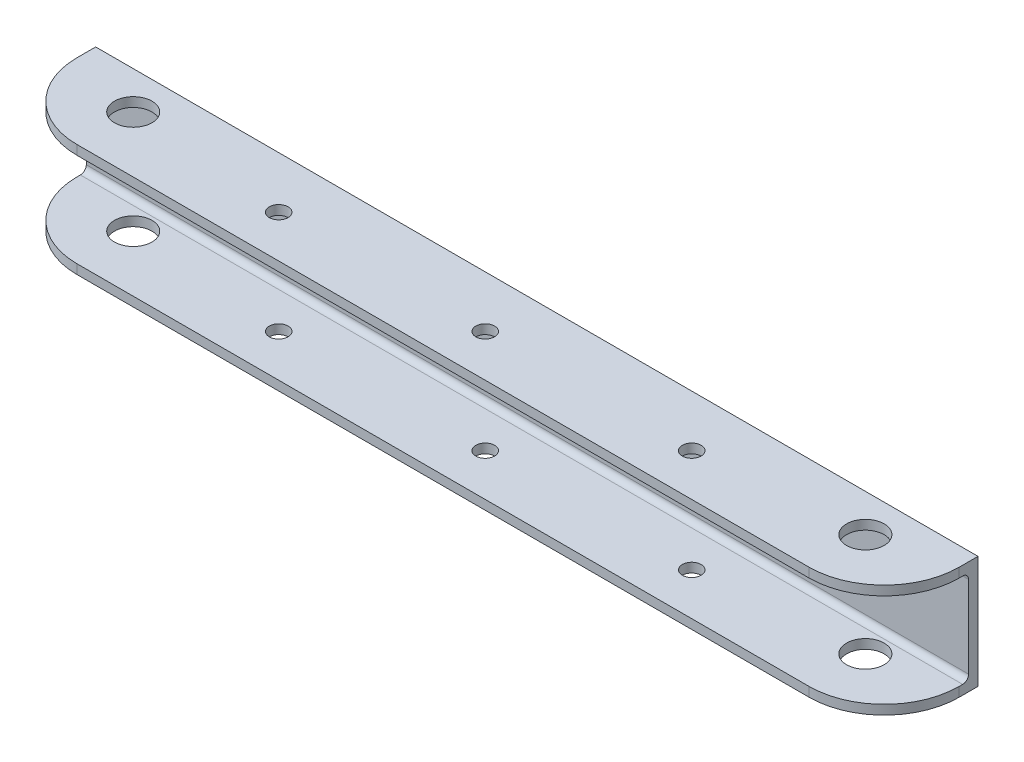
ISO-10303-21;
HEADER;
FILE_DESCRIPTION(('STEP AP214'),'2;1');
FILE_NAME('part.step','',(''),(''),'','','');
FILE_SCHEMA(('AUTOMOTIVE_DESIGN { 1 0 10303 214 1 1 1 1 }'));
ENDSEC;
DATA;
#1=APPLICATION_CONTEXT('core data for automotive mechanical design processes');
#2=APPLICATION_PROTOCOL_DEFINITION('international standard','automotive_design',2000,#1);
#3=PRODUCT_CONTEXT('',#1,'mechanical');
#4=PRODUCT('Part','Part','',(#3));
#5=PRODUCT_RELATED_PRODUCT_CATEGORY('part','',(#4));
#6=PRODUCT_DEFINITION_FORMATION('','',#4);
#7=PRODUCT_DEFINITION_CONTEXT('part definition',#1,'design');
#8=PRODUCT_DEFINITION('design','',#6,#7);
#9=PRODUCT_DEFINITION_SHAPE('','',#8);
#10=(LENGTH_UNIT() NAMED_UNIT(*) SI_UNIT(.MILLI.,.METRE.));
#11=(NAMED_UNIT(*) PLANE_ANGLE_UNIT() SI_UNIT($,.RADIAN.));
#12=(NAMED_UNIT(*) SI_UNIT($,.STERADIAN.) SOLID_ANGLE_UNIT());
#13=UNCERTAINTY_MEASURE_WITH_UNIT(LENGTH_MEASURE(1.E-05),#10,'distance_accuracy_value','');
#14=(GEOMETRIC_REPRESENTATION_CONTEXT(3) GLOBAL_UNCERTAINTY_ASSIGNED_CONTEXT((#13)) GLOBAL_UNIT_ASSIGNED_CONTEXT((#10,
#11,#12)) REPRESENTATION_CONTEXT('',''));
#15=CARTESIAN_POINT('',(0.,0.,0.));
#16=DIRECTION('',(0.,0.,1.));
#17=DIRECTION('',(1.,0.,0.));
#18=AXIS2_PLACEMENT_3D('',#15,#16,#17);
#19=CARTESIAN_POINT('',(0.,0.,31.75));
#20=DIRECTION('',(0.,0.,1.));
#21=DIRECTION('',(1.,0.,0.));
#22=AXIS2_PLACEMENT_3D('',#19,#20,#21);
#23=PLANE('',#22);
#24=DIRECTION('',(-1.,0.,0.));
#25=VECTOR('',#24,1.);
#26=CARTESIAN_POINT('',(0.,0.,31.75));
#27=LINE('',#26,#25);
#28=CARTESIAN_POINT('',(-313.675887252,0.,31.75));
#29=VERTEX_POINT('',#28);
#30=CARTESIAN_POINT('',(-561.325887252,0.,31.75));
#31=VERTEX_POINT('',#30);
#32=EDGE_CURVE('E195',#29,#31,#27,.T.);
#33=ORIENTED_EDGE('',*,*,#32,.F.);
#34=DIRECTION('',(0.,1.,0.));
#35=VECTOR('',#34,1.);
#36=CARTESIAN_POINT('',(-313.675887252,3.17499999999967,31.75));
#37=LINE('',#36,#35);
#38=CARTESIAN_POINT('',(-313.675887252,3.17499999999967,31.75));
#39=VERTEX_POINT('',#38);
#40=EDGE_CURVE('E241',#29,#39,#37,.T.);
#41=ORIENTED_EDGE('',*,*,#40,.T.);
#42=DIRECTION('',(-1.,0.,0.));
#43=VECTOR('',#42,1.);
#44=CARTESIAN_POINT('',(-288.275887252,3.17499999999967,31.75));
#45=LINE('',#44,#43);
#46=CARTESIAN_POINT('',(-561.325887252,3.17499999999967,31.75));
#47=VERTEX_POINT('',#46);
#48=EDGE_CURVE('E178',#39,#47,#45,.T.);
#49=ORIENTED_EDGE('',*,*,#48,.T.);
#50=DIRECTION('',(0.,1.,0.));
#51=VECTOR('',#50,1.);
#52=CARTESIAN_POINT('',(-561.325887252,4.90706239642227E-12,31.75));
#53=LINE('',#52,#51);
#54=EDGE_CURVE('E238',#47,#31,#53,.F.);
#55=ORIENTED_EDGE('',*,*,#54,.T.);
#56=EDGE_LOOP('',(#33,#41,#49,#55));
#57=FACE_BOUND('',#56,.T.);
#58=ADVANCED_FACE('F51',(#57),#23,.T.);
#59=CARTESIAN_POINT('',(-586.725887252,5.12910700134741E-12,31.75));
#60=DIRECTION('',(-1.,0.,0.));
#61=DIRECTION('',(0.,-1.,0.));
#62=AXIS2_PLACEMENT_3D('',#59,#60,#61);
#63=PLANE('',#62);
#64=DIRECTION('',(0.,0.,-1.));
#65=VECTOR('',#64,1.);
#66=CARTESIAN_POINT('',(-586.725887252,0.,31.75));
#67=LINE('',#66,#65);
#68=CARTESIAN_POINT('',(-586.725887252,0.,6.35));
#69=VERTEX_POINT('',#68);
#70=CARTESIAN_POINT('',(-586.725887252,0.,0.));
#71=VERTEX_POINT('',#70);
#72=EDGE_CURVE('E153',#69,#71,#67,.T.);
#73=ORIENTED_EDGE('',*,*,#72,.F.);
#74=DIRECTION('',(0.,1.,0.));
#75=VECTOR('',#74,1.);
#76=CARTESIAN_POINT('',(-586.725887252,5.12910700134741E-12,6.35));
#77=LINE('',#76,#75);
#78=CARTESIAN_POINT('',(-586.725887252,3.17499999999966,6.35000000000001));
#79=VERTEX_POINT('',#78);
#80=EDGE_CURVE('E259',#69,#79,#77,.T.);
#81=ORIENTED_EDGE('',*,*,#80,.T.);
#82=DIRECTION('',(0.,0.,1.));
#83=VECTOR('',#82,1.);
#84=CARTESIAN_POINT('',(-586.725887252,3.17499999999967,31.75));
#85=LINE('',#84,#83);
#86=CARTESIAN_POINT('',(-586.725887252,3.17499999999966,5.17500000000001));
#87=VERTEX_POINT('',#86);
#88=EDGE_CURVE('E335',#87,#79,#85,.T.);
#89=ORIENTED_EDGE('',*,*,#88,.F.);
#90=CARTESIAN_POINT('',(-586.725887252,5.17499999999966,5.175));
#91=DIRECTION('',(-1.,0.,0.));
#92=DIRECTION('',(0.,-1.,0.));
#93=AXIS2_PLACEMENT_3D('',#90,#91,#92);
#94=CIRCLE('',#93,2.);
#95=CARTESIAN_POINT('',(-586.725887252,5.17499999999966,3.175));
#96=VERTEX_POINT('',#95);
#97=EDGE_CURVE('E291',#87,#96,#94,.F.);
#98=ORIENTED_EDGE('',*,*,#97,.T.);
#99=DIRECTION('',(0.,-1.,0.));
#100=VECTOR('',#99,1.);
#101=CARTESIAN_POINT('',(-586.725887252,34.9249999999615,3.175));
#102=LINE('',#101,#100);
#103=CARTESIAN_POINT('',(-586.725887252,32.9249999999615,3.175));
#104=VERTEX_POINT('',#103);
#105=EDGE_CURVE('E330',#104,#96,#102,.T.);
#106=ORIENTED_EDGE('',*,*,#105,.F.);
#107=CARTESIAN_POINT('',(-586.725887252,32.9249999999615,5.175));
#108=DIRECTION('',(-1.,0.,0.));
#109=DIRECTION('',(0.,-1.,0.));
#110=AXIS2_PLACEMENT_3D('',#107,#108,#109);
#111=CIRCLE('',#110,2.);
#112=CARTESIAN_POINT('',(-586.725887252,34.9249999999615,5.175));
#113=VERTEX_POINT('',#112);
#114=EDGE_CURVE('E60',#104,#113,#111,.F.);
#115=ORIENTED_EDGE('',*,*,#114,.T.);
#116=DIRECTION('',(0.,0.,-1.));
#117=VECTOR('',#116,1.);
#118=CARTESIAN_POINT('',(-586.725887252,34.9249999999615,31.75));
#119=LINE('',#118,#117);
#120=CARTESIAN_POINT('',(-586.725887252,34.9249999999615,6.35));
#121=VERTEX_POINT('',#120);
#122=EDGE_CURVE('E328',#121,#113,#119,.T.);
#123=ORIENTED_EDGE('',*,*,#122,.F.);
#124=DIRECTION('',(0.,1.,0.));
#125=VECTOR('',#124,1.);
#126=CARTESIAN_POINT('',(-586.725887252,5.12910700134741E-12,6.35));
#127=LINE('',#126,#125);
#128=CARTESIAN_POINT('',(-586.725887252,38.0999999999806,6.35));
#129=VERTEX_POINT('',#128);
#130=EDGE_CURVE('E256',#121,#129,#127,.T.);
#131=ORIENTED_EDGE('',*,*,#130,.T.);
#132=DIRECTION('',(0.,0.,-1.));
#133=VECTOR('',#132,1.);
#134=CARTESIAN_POINT('',(-586.725887252,38.0999999999806,31.75));
#135=LINE('',#134,#133);
#136=CARTESIAN_POINT('',(-586.725887252,38.0999999999806,0.));
#137=VERTEX_POINT('',#136);
#138=EDGE_CURVE('E173',#129,#137,#135,.T.);
#139=ORIENTED_EDGE('',*,*,#138,.T.);
#140=DIRECTION('',(0.,1.,0.));
#141=VECTOR('',#140,1.);
#142=CARTESIAN_POINT('',(-586.725887252,5.12910700134741E-12,0.));
#143=LINE('',#142,#141);
#144=EDGE_CURVE('E169',#71,#137,#143,.T.);
#145=ORIENTED_EDGE('',*,*,#144,.F.);
#146=EDGE_LOOP('',(#73,#81,#89,#98,#106,#115,#123,#131,#139,#145));
#147=FACE_BOUND('',#146,.T.);
#148=ADVANCED_FACE('F170',(#147),#63,.T.);
#149=CARTESIAN_POINT('',(0.,0.,31.75));
#150=DIRECTION('',(0.,-1.,0.));
#151=DIRECTION('',(0.,0.,-1.));
#152=AXIS2_PLACEMENT_3D('',#149,#150,#151);
#153=PLANE('',#152);
#154=CARTESIAN_POINT('',(-507.350887252,0.,17.4625));
#155=DIRECTION('',(0.,-1.,0.));
#156=DIRECTION('',(0.,0.,-1.));
#157=AXIS2_PLACEMENT_3D('',#154,#155,#156);
#158=CIRCLE('',#157,3.17500000000008);
#159=CARTESIAN_POINT('',(-507.350887252,0.,14.2874999999999));
#160=VERTEX_POINT('',#159);
#161=EDGE_CURVE('E393',#160,#160,#158,.T.);
#162=ORIENTED_EDGE('',*,*,#161,.F.);
#163=EDGE_LOOP('',(#162));
#164=FACE_BOUND('',#163,.T.);
#165=CARTESIAN_POINT('',(-437.500887252,0.,17.4625));
#166=DIRECTION('',(0.,-1.,0.));
#167=DIRECTION('',(0.,0.,-1.));
#168=AXIS2_PLACEMENT_3D('',#165,#166,#167);
#169=CIRCLE('',#168,3.17499999999997);
#170=CARTESIAN_POINT('',(-437.500887252,0.,14.2875));
#171=VERTEX_POINT('',#170);
#172=EDGE_CURVE('E385',#171,#171,#169,.T.);
#173=ORIENTED_EDGE('',*,*,#172,.F.);
#174=EDGE_LOOP('',(#173));
#175=FACE_BOUND('',#174,.T.);
#176=CARTESIAN_POINT('',(-367.650887252,0.,17.4625));
#177=DIRECTION('',(0.,-1.,0.));
#178=DIRECTION('',(0.,0.,-1.));
#179=AXIS2_PLACEMENT_3D('',#176,#177,#178);
#180=CIRCLE('',#179,3.17499999999997);
#181=CARTESIAN_POINT('',(-367.650887252,0.,14.2875));
#182=VERTEX_POINT('',#181);
#183=EDGE_CURVE('E378',#182,#182,#180,.T.);
#184=ORIENTED_EDGE('',*,*,#183,.F.);
#185=EDGE_LOOP('',(#184));
#186=FACE_BOUND('',#185,.T.);
#187=CARTESIAN_POINT('',(-561.325887251953,0.,12.700000000014));
#188=DIRECTION('',(0.,-1.,0.));
#189=DIRECTION('',(0.,0.,-1.));
#190=AXIS2_PLACEMENT_3D('',#187,#188,#189);
#191=CIRCLE('',#190,6.3499999999972);
#192=CARTESIAN_POINT('',(-561.325887251953,0.,6.35000000001679));
#193=VERTEX_POINT('',#192);
#194=EDGE_CURVE('E365',#193,#193,#191,.T.);
#195=ORIENTED_EDGE('',*,*,#194,.F.);
#196=EDGE_LOOP('',(#195));
#197=FACE_BOUND('',#196,.T.);
#198=CARTESIAN_POINT('',(-313.675887252047,0.,12.700000000014));
#199=DIRECTION('',(0.,-1.,0.));
#200=DIRECTION('',(0.,0.,-1.));
#201=AXIS2_PLACEMENT_3D('',#198,#199,#200);
#202=CIRCLE('',#201,6.35);
#203=CARTESIAN_POINT('',(-313.675887252047,0.,6.35000000001399));
#204=VERTEX_POINT('',#203);
#205=EDGE_CURVE('E357',#204,#204,#202,.T.);
#206=ORIENTED_EDGE('',*,*,#205,.F.);
#207=EDGE_LOOP('',(#206));
#208=FACE_BOUND('',#207,.T.);
#209=DIRECTION('',(0.,0.,-1.));
#210=VECTOR('',#209,1.);
#211=CARTESIAN_POINT('',(-288.275887252,0.,31.75));
#212=LINE('',#211,#210);
#213=CARTESIAN_POINT('',(-288.275887252,0.,6.35));
#214=VERTEX_POINT('',#213);
#215=CARTESIAN_POINT('',(-288.275887252,0.,0.));
#216=VERTEX_POINT('',#215);
#217=EDGE_CURVE('E166',#214,#216,#212,.T.);
#218=ORIENTED_EDGE('',*,*,#217,.F.);
#219=CARTESIAN_POINT('',(-313.675887252,0.,6.35));
#220=DIRECTION('',(0.,-1.,0.));
#221=DIRECTION('',(0.,0.,-1.));
#222=AXIS2_PLACEMENT_3D('',#219,#220,#221);
#223=CIRCLE('',#222,25.4);
#224=EDGE_CURVE('E253',#214,#29,#223,.T.);
#225=ORIENTED_EDGE('',*,*,#224,.T.);
#226=ORIENTED_EDGE('',*,*,#32,.T.);
#227=CARTESIAN_POINT('',(-561.325887252,0.,6.35));
#228=DIRECTION('',(0.,-1.,0.));
#229=DIRECTION('',(0.,0.,-1.));
#230=AXIS2_PLACEMENT_3D('',#227,#228,#229);
#231=CIRCLE('',#230,25.4);
#232=EDGE_CURVE('E161',#31,#69,#231,.T.);
#233=ORIENTED_EDGE('',*,*,#232,.T.);
#234=ORIENTED_EDGE('',*,*,#72,.T.);
#235=DIRECTION('',(-1.,0.,0.));
#236=VECTOR('',#235,1.);
#237=CARTESIAN_POINT('',(0.,0.,0.));
#238=LINE('',#237,#236);
#239=EDGE_CURVE('E158',#216,#71,#238,.T.);
#240=ORIENTED_EDGE('',*,*,#239,.F.);
#241=EDGE_LOOP('',(#218,#225,#226,#233,#234,#240));
#242=FACE_BOUND('',#241,.T.);
#243=ADVANCED_FACE('F156',(#164,#175,#186,#197,#208,#242),#153,.T.);
#244=CARTESIAN_POINT('',(-288.275887252,0.,31.75));
#245=DIRECTION('',(-1.,0.,0.));
#246=DIRECTION('',(0.,0.,1.));
#247=AXIS2_PLACEMENT_3D('',#244,#245,#246);
#248=PLANE('',#247);
#249=DIRECTION('',(0.,0.,-1.));
#250=VECTOR('',#249,1.);
#251=CARTESIAN_POINT('',(-288.275887252,38.0999999999802,31.75));
#252=LINE('',#251,#250);
#253=CARTESIAN_POINT('',(-288.275887252,38.0999999999802,6.35));
#254=VERTEX_POINT('',#253);
#255=CARTESIAN_POINT('',(-288.275887252,38.0999999999802,0.));
#256=VERTEX_POINT('',#255);
#257=EDGE_CURVE('E198',#254,#256,#252,.T.);
#258=ORIENTED_EDGE('',*,*,#257,.F.);
#259=DIRECTION('',(0.,1.,0.));
#260=VECTOR('',#259,1.);
#261=CARTESIAN_POINT('',(-288.275887252,34.9249999999615,6.35));
#262=LINE('',#261,#260);
#263=CARTESIAN_POINT('',(-288.275887252,34.9249999999615,6.35));
#264=VERTEX_POINT('',#263);
#265=EDGE_CURVE('E229',#254,#264,#262,.F.);
#266=ORIENTED_EDGE('',*,*,#265,.T.);
#267=DIRECTION('',(0.,0.,-1.));
#268=VECTOR('',#267,1.);
#269=CARTESIAN_POINT('',(-288.275887252,34.9249999999615,31.75));
#270=LINE('',#269,#268);
#271=CARTESIAN_POINT('',(-288.275887252,34.9249999999615,5.175));
#272=VERTEX_POINT('',#271);
#273=EDGE_CURVE('E342',#264,#272,#270,.T.);
#274=ORIENTED_EDGE('',*,*,#273,.T.);
#275=CARTESIAN_POINT('',(-288.275887252,32.9249999999615,5.175));
#276=DIRECTION('',(-1.,0.,0.));
#277=DIRECTION('',(0.,0.,1.));
#278=AXIS2_PLACEMENT_3D('',#275,#276,#277);
#279=CIRCLE('',#278,2.);
#280=CARTESIAN_POINT('',(-288.275887252,32.9249999999615,3.175));
#281=VERTEX_POINT('',#280);
#282=EDGE_CURVE('E12',#272,#281,#279,.T.);
#283=ORIENTED_EDGE('',*,*,#282,.T.);
#284=DIRECTION('',(0.,-1.,0.));
#285=VECTOR('',#284,1.);
#286=CARTESIAN_POINT('',(-288.275887252,34.9249999999615,3.175));
#287=LINE('',#286,#285);
#288=CARTESIAN_POINT('',(-288.275887252,5.17499999999966,3.175));
#289=VERTEX_POINT('',#288);
#290=EDGE_CURVE('E303',#281,#289,#287,.T.);
#291=ORIENTED_EDGE('',*,*,#290,.T.);
#292=CARTESIAN_POINT('',(-288.275887252,5.17499999999966,5.175));
#293=DIRECTION('',(-1.,0.,0.));
#294=DIRECTION('',(0.,0.,1.));
#295=AXIS2_PLACEMENT_3D('',#292,#293,#294);
#296=CIRCLE('',#295,2.);
#297=CARTESIAN_POINT('',(-288.275887252,3.17499999999966,5.17500000000001));
#298=VERTEX_POINT('',#297);
#299=EDGE_CURVE('E294',#289,#298,#296,.T.);
#300=ORIENTED_EDGE('',*,*,#299,.T.);
#301=DIRECTION('',(0.,0.,1.));
#302=VECTOR('',#301,1.);
#303=CARTESIAN_POINT('',(-288.275887252,3.17499999999967,31.75));
#304=LINE('',#303,#302);
#305=CARTESIAN_POINT('',(-288.275887252,3.17499999999966,6.35000000000001));
#306=VERTEX_POINT('',#305);
#307=EDGE_CURVE('E301',#298,#306,#304,.T.);
#308=ORIENTED_EDGE('',*,*,#307,.T.);
#309=DIRECTION('',(0.,1.,0.));
#310=VECTOR('',#309,1.);
#311=CARTESIAN_POINT('',(-288.275887252,0.,6.35));
#312=LINE('',#311,#310);
#313=EDGE_CURVE('E226',#306,#214,#312,.F.);
#314=ORIENTED_EDGE('',*,*,#313,.T.);
#315=ORIENTED_EDGE('',*,*,#217,.T.);
#316=DIRECTION('',(0.,1.,0.));
#317=VECTOR('',#316,1.);
#318=CARTESIAN_POINT('',(-288.275887252,0.,0.));
#319=LINE('',#318,#317);
#320=EDGE_CURVE('E183',#216,#256,#319,.T.);
#321=ORIENTED_EDGE('',*,*,#320,.T.);
#322=EDGE_LOOP('',(#258,#266,#274,#283,#291,#300,#308,#314,#315,#321));
#323=FACE_BOUND('',#322,.T.);
#324=ADVANCED_FACE('F455',(#323),#248,.F.);
#325=CARTESIAN_POINT('',(1.82145964977459E-13,38.0999999999778,31.75));
#326=DIRECTION('',(0.,-1.,0.));
#327=DIRECTION('',(1.,0.,0.));
#328=AXIS2_PLACEMENT_3D('',#325,#326,#327);
#329=PLANE('',#328);
#330=CARTESIAN_POINT('',(-507.350887252,38.0999999999806,17.4625));
#331=DIRECTION('',(0.,-1.,0.));
#332=DIRECTION('',(0.,0.,-1.));
#333=AXIS2_PLACEMENT_3D('',#330,#331,#332);
#334=CIRCLE('',#333,3.17500000000008);
#335=CARTESIAN_POINT('',(-507.350887252,38.0999999999806,14.2874999999999));
#336=VERTEX_POINT('',#335);
#337=EDGE_CURVE('E268',#336,#336,#334,.T.);
#338=ORIENTED_EDGE('',*,*,#337,.T.);
#339=EDGE_LOOP('',(#338));
#340=FACE_BOUND('',#339,.T.);
#341=CARTESIAN_POINT('',(-437.500887252,38.0999999999806,17.4625));
#342=DIRECTION('',(0.,-1.,0.));
#343=DIRECTION('',(0.,0.,-1.));
#344=AXIS2_PLACEMENT_3D('',#341,#342,#343);
#345=CIRCLE('',#344,3.17499999999997);
#346=CARTESIAN_POINT('',(-437.500887252,38.0999999999806,14.2875));
#347=VERTEX_POINT('',#346);
#348=EDGE_CURVE('E389',#347,#347,#345,.T.);
#349=ORIENTED_EDGE('',*,*,#348,.T.);
#350=EDGE_LOOP('',(#349));
#351=FACE_BOUND('',#350,.T.);
#352=CARTESIAN_POINT('',(-367.650887252,38.0999999999806,17.4625));
#353=DIRECTION('',(0.,-1.,0.));
#354=DIRECTION('',(0.,0.,-1.));
#355=AXIS2_PLACEMENT_3D('',#352,#353,#354);
#356=CIRCLE('',#355,3.17499999999997);
#357=CARTESIAN_POINT('',(-367.650887252,38.0999999999806,14.2875));
#358=VERTEX_POINT('',#357);
#359=EDGE_CURVE('E382',#358,#358,#356,.T.);
#360=ORIENTED_EDGE('',*,*,#359,.T.);
#361=EDGE_LOOP('',(#360));
#362=FACE_BOUND('',#361,.T.);
#363=CARTESIAN_POINT('',(-561.325887251953,38.0999999999806,12.700000000014));
#364=DIRECTION('',(0.,-1.,0.));
#365=DIRECTION('',(0.,0.,-1.));
#366=AXIS2_PLACEMENT_3D('',#363,#364,#365);
#367=CIRCLE('',#366,6.3499999999972);
#368=CARTESIAN_POINT('',(-561.325887251953,38.0999999999806,6.35000000001679));
#369=VERTEX_POINT('',#368);
#370=EDGE_CURVE('E209',#369,#369,#367,.T.);
#371=ORIENTED_EDGE('',*,*,#370,.T.);
#372=EDGE_LOOP('',(#371));
#373=FACE_BOUND('',#372,.T.);
#374=CARTESIAN_POINT('',(-313.675887252047,38.0999999999806,12.700000000014));
#375=DIRECTION('',(0.,-1.,0.));
#376=DIRECTION('',(0.,0.,-1.));
#377=AXIS2_PLACEMENT_3D('',#374,#375,#376);
#378=CIRCLE('',#377,6.35);
#379=CARTESIAN_POINT('',(-313.675887252047,38.0999999999806,6.35000000001399));
#380=VERTEX_POINT('',#379);
#381=EDGE_CURVE('E361',#380,#380,#378,.T.);
#382=ORIENTED_EDGE('',*,*,#381,.T.);
#383=EDGE_LOOP('',(#382));
#384=FACE_BOUND('',#383,.T.);
#385=DIRECTION('',(-1.,0.,0.));
#386=VECTOR('',#385,1.);
#387=CARTESIAN_POINT('',(1.82145964977459E-13,38.0999999999778,31.75));
#388=LINE('',#387,#386);
#389=CARTESIAN_POINT('',(-313.675887252,38.0999999999793,31.75));
#390=VERTEX_POINT('',#389);
#391=CARTESIAN_POINT('',(-561.325887252,38.0999999999805,31.75));
#392=VERTEX_POINT('',#391);
#393=EDGE_CURVE('E199',#390,#392,#388,.T.);
#394=ORIENTED_EDGE('',*,*,#393,.F.);
#395=CARTESIAN_POINT('',(-313.675887252,38.0999999999793,6.35));
#396=DIRECTION('',(0.,-1.,0.));
#397=DIRECTION('',(1.,0.,0.));
#398=AXIS2_PLACEMENT_3D('',#395,#396,#397);
#399=CIRCLE('',#398,25.4);
#400=EDGE_CURVE('E223',#390,#254,#399,.F.);
#401=ORIENTED_EDGE('',*,*,#400,.T.);
#402=ORIENTED_EDGE('',*,*,#257,.T.);
#403=DIRECTION('',(-1.,0.,0.));
#404=VECTOR('',#403,1.);
#405=CARTESIAN_POINT('',(1.82145964977459E-13,38.0999999999778,0.));
#406=LINE('',#405,#404);
#407=EDGE_CURVE('E189',#256,#137,#406,.T.);
#408=ORIENTED_EDGE('',*,*,#407,.T.);
#409=ORIENTED_EDGE('',*,*,#138,.F.);
#410=CARTESIAN_POINT('',(-561.325887252,38.0999999999805,6.35));
#411=DIRECTION('',(0.,-1.,0.));
#412=DIRECTION('',(1.,0.,0.));
#413=AXIS2_PLACEMENT_3D('',#410,#411,#412);
#414=CIRCLE('',#413,25.4);
#415=EDGE_CURVE('E220',#129,#392,#414,.F.);
#416=ORIENTED_EDGE('',*,*,#415,.T.);
#417=EDGE_LOOP('',(#394,#401,#402,#408,#409,#416));
#418=FACE_BOUND('',#417,.T.);
#419=ADVANCED_FACE('F400',(#340,#351,#362,#373,#384,#418),#329,.F.);
#420=DIRECTION('',(-1.,0.,0.));
#421=VECTOR('',#420,1.);
#422=CARTESIAN_POINT('',(-288.275887252,34.9249999999615,31.75));
#423=LINE('',#422,#421);
#424=CARTESIAN_POINT('',(-313.675887252,34.9249999999615,31.75));
#425=VERTEX_POINT('',#424);
#426=CARTESIAN_POINT('',(-561.325887252,34.9249999999615,31.75));
#427=VERTEX_POINT('',#426);
#428=EDGE_CURVE('E302',#425,#427,#423,.T.);
#429=ORIENTED_EDGE('',*,*,#428,.F.);
#430=DIRECTION('',(0.,1.,0.));
#431=VECTOR('',#430,1.);
#432=CARTESIAN_POINT('',(-313.675887252,38.0999999999802,31.75));
#433=LINE('',#432,#431);
#434=EDGE_CURVE('E216',#425,#390,#433,.T.);
#435=ORIENTED_EDGE('',*,*,#434,.T.);
#436=ORIENTED_EDGE('',*,*,#393,.T.);
#437=DIRECTION('',(0.,1.,0.));
#438=VECTOR('',#437,1.);
#439=CARTESIAN_POINT('',(-561.325887252,4.90706239642227E-12,31.75));
#440=LINE('',#439,#438);
#441=EDGE_CURVE('E165',#392,#427,#440,.F.);
#442=ORIENTED_EDGE('',*,*,#441,.T.);
#443=EDGE_LOOP('',(#429,#435,#436,#442));
#444=FACE_BOUND('',#443,.T.);
#445=ADVANCED_FACE('F321',(#444),#23,.T.);
#446=CARTESIAN_POINT('',(0.,0.,0.));
#447=DIRECTION('',(0.,0.,1.));
#448=DIRECTION('',(1.,0.,0.));
#449=AXIS2_PLACEMENT_3D('',#446,#447,#448);
#450=PLANE('',#449);
#451=ORIENTED_EDGE('',*,*,#144,.T.);
#452=ORIENTED_EDGE('',*,*,#407,.F.);
#453=ORIENTED_EDGE('',*,*,#320,.F.);
#454=ORIENTED_EDGE('',*,*,#239,.T.);
#455=EDGE_LOOP('',(#451,#452,#453,#454));
#456=FACE_BOUND('',#455,.T.);
#457=ADVANCED_FACE('F181',(#456),#450,.F.);
#458=CARTESIAN_POINT('',(-288.275887252,3.17499999999967,31.75));
#459=DIRECTION('',(0.,-1.,0.));
#460=DIRECTION('',(0.,0.,-1.));
#461=AXIS2_PLACEMENT_3D('',#458,#459,#460);
#462=PLANE('',#461);
#463=CARTESIAN_POINT('',(-507.350887252,3.17499999999966,17.4625));
#464=DIRECTION('',(0.,-1.,0.));
#465=DIRECTION('',(0.,0.,-1.));
#466=AXIS2_PLACEMENT_3D('',#463,#464,#465);
#467=CIRCLE('',#466,3.17500000000008);
#468=CARTESIAN_POINT('',(-507.350887252,3.17499999999966,14.2874999999999));
#469=VERTEX_POINT('',#468);
#470=EDGE_CURVE('E278',#469,#469,#467,.T.);
#471=ORIENTED_EDGE('',*,*,#470,.T.);
#472=EDGE_LOOP('',(#471));
#473=FACE_BOUND('',#472,.T.);
#474=CARTESIAN_POINT('',(-437.500887252,3.17499999999966,17.4625));
#475=DIRECTION('',(0.,-1.,0.));
#476=DIRECTION('',(0.,0.,-1.));
#477=AXIS2_PLACEMENT_3D('',#474,#475,#476);
#478=CIRCLE('',#477,3.17499999999997);
#479=CARTESIAN_POINT('',(-437.500887252,3.17499999999966,14.2875));
#480=VERTEX_POINT('',#479);
#481=EDGE_CURVE('E273',#480,#480,#478,.T.);
#482=ORIENTED_EDGE('',*,*,#481,.T.);
#483=EDGE_LOOP('',(#482));
#484=FACE_BOUND('',#483,.T.);
#485=CARTESIAN_POINT('',(-367.650887252,3.17499999999966,17.4625));
#486=DIRECTION('',(0.,-1.,0.));
#487=DIRECTION('',(0.,0.,-1.));
#488=AXIS2_PLACEMENT_3D('',#485,#486,#487);
#489=CIRCLE('',#488,3.17499999999997);
#490=CARTESIAN_POINT('',(-367.650887252,3.17499999999966,14.2875));
#491=VERTEX_POINT('',#490);
#492=EDGE_CURVE('E267',#491,#491,#489,.T.);
#493=ORIENTED_EDGE('',*,*,#492,.T.);
#494=EDGE_LOOP('',(#493));
#495=FACE_BOUND('',#494,.T.);
#496=CARTESIAN_POINT('',(-561.325887251953,3.17499999999966,12.700000000014));
#497=DIRECTION('',(0.,-1.,0.));
#498=DIRECTION('',(0.,0.,-1.));
#499=AXIS2_PLACEMENT_3D('',#496,#497,#498);
#500=CIRCLE('',#499,6.3499999999972);
#501=CARTESIAN_POINT('',(-561.325887251953,3.17499999999966,6.35000000001679));
#502=VERTEX_POINT('',#501);
#503=EDGE_CURVE('E213',#502,#502,#500,.T.);
#504=ORIENTED_EDGE('',*,*,#503,.T.);
#505=EDGE_LOOP('',(#504));
#506=FACE_BOUND('',#505,.T.);
#507=CARTESIAN_POINT('',(-313.675887252047,3.17499999999966,12.700000000014));
#508=DIRECTION('',(0.,-1.,0.));
#509=DIRECTION('',(0.,0.,-1.));
#510=AXIS2_PLACEMENT_3D('',#507,#508,#509);
#511=CIRCLE('',#510,6.35);
#512=CARTESIAN_POINT('',(-313.675887252047,3.17499999999966,6.35000000001399));
#513=VERTEX_POINT('',#512);
#514=EDGE_CURVE('E208',#513,#513,#511,.T.);
#515=ORIENTED_EDGE('',*,*,#514,.T.);
#516=EDGE_LOOP('',(#515));
#517=FACE_BOUND('',#516,.T.);
#518=ORIENTED_EDGE('',*,*,#307,.F.);
#519=DIRECTION('',(-1.,0.,0.));
#520=VECTOR('',#519,1.);
#521=CARTESIAN_POINT('',(-586.725887252,3.17499999999966,5.175));
#522=LINE('',#521,#520);
#523=EDGE_CURVE('E262',#298,#87,#522,.T.);
#524=ORIENTED_EDGE('',*,*,#523,.T.);
#525=ORIENTED_EDGE('',*,*,#88,.T.);
#526=CARTESIAN_POINT('',(-561.325887252,3.17499999999966,6.35));
#527=DIRECTION('',(0.,-1.,0.));
#528=DIRECTION('',(0.,0.,-1.));
#529=AXIS2_PLACEMENT_3D('',#526,#527,#528);
#530=CIRCLE('',#529,25.4);
#531=EDGE_CURVE('E245',#79,#47,#530,.F.);
#532=ORIENTED_EDGE('',*,*,#531,.T.);
#533=ORIENTED_EDGE('',*,*,#48,.F.);
#534=CARTESIAN_POINT('',(-313.675887252,3.17499999999966,6.35));
#535=DIRECTION('',(0.,-1.,0.));
#536=DIRECTION('',(0.,0.,-1.));
#537=AXIS2_PLACEMENT_3D('',#534,#535,#536);
#538=CIRCLE('',#537,25.4);
#539=EDGE_CURVE('E247',#39,#306,#538,.F.);
#540=ORIENTED_EDGE('',*,*,#539,.T.);
#541=EDGE_LOOP('',(#518,#524,#525,#532,#533,#540));
#542=FACE_BOUND('',#541,.T.);
#543=ADVANCED_FACE('F454',(#473,#484,#495,#506,#517,#542),#462,.F.);
#544=CARTESIAN_POINT('',(-288.275887252,34.9249999999615,3.175));
#545=DIRECTION('',(0.,0.,-1.));
#546=DIRECTION('',(0.,1.,0.));
#547=AXIS2_PLACEMENT_3D('',#544,#545,#546);
#548=PLANE('',#547);
#549=ORIENTED_EDGE('',*,*,#105,.T.);
#550=DIRECTION('',(-1.,0.,0.));
#551=VECTOR('',#550,1.);
#552=CARTESIAN_POINT('',(-288.275887252,5.17499999999966,3.175));
#553=LINE('',#552,#551);
#554=EDGE_CURVE('E286',#96,#289,#553,.F.);
#555=ORIENTED_EDGE('',*,*,#554,.T.);
#556=ORIENTED_EDGE('',*,*,#290,.F.);
#557=DIRECTION('',(-1.,0.,0.));
#558=VECTOR('',#557,1.);
#559=CARTESIAN_POINT('',(-586.725887252,32.9249999999615,3.175));
#560=LINE('',#559,#558);
#561=EDGE_CURVE('E282',#281,#104,#560,.T.);
#562=ORIENTED_EDGE('',*,*,#561,.T.);
#563=EDGE_LOOP('',(#549,#555,#556,#562));
#564=FACE_BOUND('',#563,.T.);
#565=ADVANCED_FACE('F415',(#564),#548,.F.);
#566=CARTESIAN_POINT('',(-288.275887252,34.9249999999615,31.75));
#567=DIRECTION('',(0.,1.,0.));
#568=DIRECTION('',(0.,0.,1.));
#569=AXIS2_PLACEMENT_3D('',#566,#567,#568);
#570=PLANE('',#569);
#571=CARTESIAN_POINT('',(-507.350887252,34.9249999999615,17.4625));
#572=DIRECTION('',(0.,1.,0.));
#573=DIRECTION('',(0.,0.,1.));
#574=AXIS2_PLACEMENT_3D('',#571,#572,#573);
#575=CIRCLE('',#574,3.17500000000008);
#576=CARTESIAN_POINT('',(-507.350887252,34.9249999999615,20.6375000000001));
#577=VERTEX_POINT('',#576);
#578=EDGE_CURVE('E274',#577,#577,#575,.T.);
#579=ORIENTED_EDGE('',*,*,#578,.T.);
#580=EDGE_LOOP('',(#579));
#581=FACE_BOUND('',#580,.T.);
#582=CARTESIAN_POINT('',(-437.500887252,34.9249999999615,17.4625));
#583=DIRECTION('',(0.,1.,0.));
#584=DIRECTION('',(0.,0.,1.));
#585=AXIS2_PLACEMENT_3D('',#582,#583,#584);
#586=CIRCLE('',#585,3.17499999999997);
#587=CARTESIAN_POINT('',(-437.500887252,34.9249999999615,20.6375));
#588=VERTEX_POINT('',#587);
#589=EDGE_CURVE('E269',#588,#588,#586,.T.);
#590=ORIENTED_EDGE('',*,*,#589,.T.);
#591=EDGE_LOOP('',(#590));
#592=FACE_BOUND('',#591,.T.);
#593=CARTESIAN_POINT('',(-367.650887252,34.9249999999615,17.4625));
#594=DIRECTION('',(0.,1.,0.));
#595=DIRECTION('',(0.,0.,1.));
#596=AXIS2_PLACEMENT_3D('',#593,#594,#595);
#597=CIRCLE('',#596,3.17499999999997);
#598=CARTESIAN_POINT('',(-367.650887252,34.9249999999615,20.6375));
#599=VERTEX_POINT('',#598);
#600=EDGE_CURVE('E263',#599,#599,#597,.T.);
#601=ORIENTED_EDGE('',*,*,#600,.T.);
#602=EDGE_LOOP('',(#601));
#603=FACE_BOUND('',#602,.T.);
#604=CARTESIAN_POINT('',(-561.325887251953,34.9249999999615,12.700000000014));
#605=DIRECTION('',(0.,1.,0.));
#606=DIRECTION('',(0.,0.,1.));
#607=AXIS2_PLACEMENT_3D('',#604,#605,#606);
#608=CIRCLE('',#607,6.3499999999972);
#609=CARTESIAN_POINT('',(-561.325887251953,34.9249999999615,19.0500000000112));
#610=VERTEX_POINT('',#609);
#611=EDGE_CURVE('E210',#610,#610,#608,.T.);
#612=ORIENTED_EDGE('',*,*,#611,.T.);
#613=EDGE_LOOP('',(#612));
#614=FACE_BOUND('',#613,.T.);
#615=CARTESIAN_POINT('',(-313.675887252047,34.9249999999615,12.700000000014));
#616=DIRECTION('',(0.,1.,0.));
#617=DIRECTION('',(0.,0.,1.));
#618=AXIS2_PLACEMENT_3D('',#615,#616,#617);
#619=CIRCLE('',#618,6.35);
#620=CARTESIAN_POINT('',(-313.675887252047,34.9249999999615,19.050000000014));
#621=VERTEX_POINT('',#620);
#622=EDGE_CURVE('E204',#621,#621,#619,.T.);
#623=ORIENTED_EDGE('',*,*,#622,.T.);
#624=EDGE_LOOP('',(#623));
#625=FACE_BOUND('',#624,.T.);
#626=ORIENTED_EDGE('',*,*,#122,.T.);
#627=DIRECTION('',(-1.,0.,0.));
#628=VECTOR('',#627,1.);
#629=CARTESIAN_POINT('',(-288.275887252,34.9249999999615,5.175));
#630=LINE('',#629,#628);
#631=EDGE_CURVE('E73',#113,#272,#630,.F.);
#632=ORIENTED_EDGE('',*,*,#631,.T.);
#633=ORIENTED_EDGE('',*,*,#273,.F.);
#634=CARTESIAN_POINT('',(-313.675887252,34.9249999999615,6.35));
#635=DIRECTION('',(0.,1.,0.));
#636=DIRECTION('',(0.,0.,1.));
#637=AXIS2_PLACEMENT_3D('',#634,#635,#636);
#638=CIRCLE('',#637,25.4);
#639=EDGE_CURVE('E235',#264,#425,#638,.F.);
#640=ORIENTED_EDGE('',*,*,#639,.T.);
#641=ORIENTED_EDGE('',*,*,#428,.T.);
#642=CARTESIAN_POINT('',(-561.325887252,34.9249999999615,6.35));
#643=DIRECTION('',(0.,1.,0.));
#644=DIRECTION('',(0.,0.,1.));
#645=AXIS2_PLACEMENT_3D('',#642,#643,#644);
#646=CIRCLE('',#645,25.4);
#647=EDGE_CURVE('E232',#427,#121,#646,.F.);
#648=ORIENTED_EDGE('',*,*,#647,.T.);
#649=EDGE_LOOP('',(#626,#632,#633,#640,#641,#648));
#650=FACE_BOUND('',#649,.T.);
#651=ADVANCED_FACE('F327',(#581,#592,#603,#614,#625,#650),#570,.F.);
#652=CARTESIAN_POINT('',(-313.675887252047,38.0999999999806,12.700000000014));
#653=DIRECTION('',(0.,-1.,0.));
#654=DIRECTION('',(0.,0.,-1.));
#655=AXIS2_PLACEMENT_3D('',#652,#653,#654);
#656=CYLINDRICAL_SURFACE('',#655,6.35);
#657=ORIENTED_EDGE('',*,*,#381,.F.);
#658=EDGE_LOOP('',(#657));
#659=FACE_BOUND('',#658,.T.);
#660=ORIENTED_EDGE('',*,*,#622,.F.);
#661=EDGE_LOOP('',(#660));
#662=FACE_BOUND('',#661,.T.);
#663=ADVANCED_FACE('F414',(#659,#662),#656,.F.);
#664=CARTESIAN_POINT('',(-561.325887251953,38.0999999999806,12.700000000014));
#665=DIRECTION('',(0.,-1.,0.));
#666=DIRECTION('',(0.,0.,-1.));
#667=AXIS2_PLACEMENT_3D('',#664,#665,#666);
#668=CYLINDRICAL_SURFACE('',#667,6.3499999999972);
#669=ORIENTED_EDGE('',*,*,#370,.F.);
#670=EDGE_LOOP('',(#669));
#671=FACE_BOUND('',#670,.T.);
#672=ORIENTED_EDGE('',*,*,#611,.F.);
#673=EDGE_LOOP('',(#672));
#674=FACE_BOUND('',#673,.T.);
#675=ADVANCED_FACE('F426',(#671,#674),#668,.F.);
#676=ORIENTED_EDGE('',*,*,#205,.T.);
#677=EDGE_LOOP('',(#676));
#678=FACE_BOUND('',#677,.T.);
#679=ORIENTED_EDGE('',*,*,#514,.F.);
#680=EDGE_LOOP('',(#679));
#681=FACE_BOUND('',#680,.T.);
#682=ADVANCED_FACE('F429',(#678,#681),#656,.F.);
#683=ORIENTED_EDGE('',*,*,#194,.T.);
#684=EDGE_LOOP('',(#683));
#685=FACE_BOUND('',#684,.T.);
#686=ORIENTED_EDGE('',*,*,#503,.F.);
#687=EDGE_LOOP('',(#686));
#688=FACE_BOUND('',#687,.T.);
#689=ADVANCED_FACE('F435',(#685,#688),#668,.F.);
#690=CARTESIAN_POINT('',(-313.675887252,0.,6.35));
#691=DIRECTION('',(0.,-1.,0.));
#692=DIRECTION('',(0.,0.,-1.));
#693=AXIS2_PLACEMENT_3D('',#690,#691,#692);
#694=CYLINDRICAL_SURFACE('',#693,25.4);
#695=ORIENTED_EDGE('',*,*,#639,.F.);
#696=ORIENTED_EDGE('',*,*,#265,.F.);
#697=ORIENTED_EDGE('',*,*,#400,.F.);
#698=ORIENTED_EDGE('',*,*,#434,.F.);
#699=EDGE_LOOP('',(#695,#696,#697,#698));
#700=FACE_BOUND('',#699,.T.);
#701=ADVANCED_FACE('F465',(#700),#694,.T.);
#702=CARTESIAN_POINT('',(-313.675887252,0.,6.35));
#703=DIRECTION('',(0.,-1.,0.));
#704=DIRECTION('',(0.,0.,-1.));
#705=AXIS2_PLACEMENT_3D('',#702,#703,#704);
#706=CYLINDRICAL_SURFACE('',#705,25.4);
#707=ORIENTED_EDGE('',*,*,#224,.F.);
#708=ORIENTED_EDGE('',*,*,#313,.F.);
#709=ORIENTED_EDGE('',*,*,#539,.F.);
#710=ORIENTED_EDGE('',*,*,#40,.F.);
#711=EDGE_LOOP('',(#707,#708,#709,#710));
#712=FACE_BOUND('',#711,.T.);
#713=ADVANCED_FACE('F468',(#712),#706,.T.);
#714=CARTESIAN_POINT('',(-561.325887252,4.90706239642227E-12,6.35));
#715=DIRECTION('',(0.,1.,0.));
#716=DIRECTION('',(-1.,0.,0.));
#717=AXIS2_PLACEMENT_3D('',#714,#715,#716);
#718=CYLINDRICAL_SURFACE('',#717,25.4);
#719=ORIENTED_EDGE('',*,*,#232,.F.);
#720=ORIENTED_EDGE('',*,*,#54,.F.);
#721=ORIENTED_EDGE('',*,*,#531,.F.);
#722=ORIENTED_EDGE('',*,*,#80,.F.);
#723=EDGE_LOOP('',(#719,#720,#721,#722));
#724=FACE_BOUND('',#723,.T.);
#725=ADVANCED_FACE('F472',(#724),#718,.T.);
#726=CARTESIAN_POINT('',(-561.325887252,4.90706239642227E-12,6.35));
#727=DIRECTION('',(0.,1.,0.));
#728=DIRECTION('',(-1.,0.,0.));
#729=AXIS2_PLACEMENT_3D('',#726,#727,#728);
#730=CYLINDRICAL_SURFACE('',#729,25.4);
#731=ORIENTED_EDGE('',*,*,#647,.F.);
#732=ORIENTED_EDGE('',*,*,#441,.F.);
#733=ORIENTED_EDGE('',*,*,#415,.F.);
#734=ORIENTED_EDGE('',*,*,#130,.F.);
#735=EDGE_LOOP('',(#731,#732,#733,#734));
#736=FACE_BOUND('',#735,.T.);
#737=ADVANCED_FACE('F325',(#736),#730,.T.);
#738=CARTESIAN_POINT('',(-367.650887252,38.0999999999806,17.4625));
#739=DIRECTION('',(0.,-1.,0.));
#740=DIRECTION('',(0.,0.,-1.));
#741=AXIS2_PLACEMENT_3D('',#738,#739,#740);
#742=CYLINDRICAL_SURFACE('',#741,3.17499999999997);
#743=ORIENTED_EDGE('',*,*,#359,.F.);
#744=EDGE_LOOP('',(#743));
#745=FACE_BOUND('',#744,.T.);
#746=ORIENTED_EDGE('',*,*,#600,.F.);
#747=EDGE_LOOP('',(#746));
#748=FACE_BOUND('',#747,.T.);
#749=ADVANCED_FACE('F478',(#745,#748),#742,.F.);
#750=CARTESIAN_POINT('',(-437.500887252,38.0999999999806,17.4625));
#751=DIRECTION('',(0.,-1.,0.));
#752=DIRECTION('',(0.,0.,-1.));
#753=AXIS2_PLACEMENT_3D('',#750,#751,#752);
#754=CYLINDRICAL_SURFACE('',#753,3.17499999999997);
#755=ORIENTED_EDGE('',*,*,#348,.F.);
#756=EDGE_LOOP('',(#755));
#757=FACE_BOUND('',#756,.T.);
#758=ORIENTED_EDGE('',*,*,#589,.F.);
#759=EDGE_LOOP('',(#758));
#760=FACE_BOUND('',#759,.T.);
#761=ADVANCED_FACE('F407',(#757,#760),#754,.F.);
#762=CARTESIAN_POINT('',(-507.350887252,38.0999999999806,17.4625));
#763=DIRECTION('',(0.,-1.,0.));
#764=DIRECTION('',(0.,0.,-1.));
#765=AXIS2_PLACEMENT_3D('',#762,#763,#764);
#766=CYLINDRICAL_SURFACE('',#765,3.17500000000008);
#767=ORIENTED_EDGE('',*,*,#337,.F.);
#768=EDGE_LOOP('',(#767));
#769=FACE_BOUND('',#768,.T.);
#770=ORIENTED_EDGE('',*,*,#578,.F.);
#771=EDGE_LOOP('',(#770));
#772=FACE_BOUND('',#771,.T.);
#773=ADVANCED_FACE('F403',(#769,#772),#766,.F.);
#774=ORIENTED_EDGE('',*,*,#183,.T.);
#775=EDGE_LOOP('',(#774));
#776=FACE_BOUND('',#775,.T.);
#777=ORIENTED_EDGE('',*,*,#492,.F.);
#778=EDGE_LOOP('',(#777));
#779=FACE_BOUND('',#778,.T.);
#780=ADVANCED_FACE('F406',(#776,#779),#742,.F.);
#781=ORIENTED_EDGE('',*,*,#172,.T.);
#782=EDGE_LOOP('',(#781));
#783=FACE_BOUND('',#782,.T.);
#784=ORIENTED_EDGE('',*,*,#481,.F.);
#785=EDGE_LOOP('',(#784));
#786=FACE_BOUND('',#785,.T.);
#787=ADVANCED_FACE('F487',(#783,#786),#754,.F.);
#788=ORIENTED_EDGE('',*,*,#161,.T.);
#789=EDGE_LOOP('',(#788));
#790=FACE_BOUND('',#789,.T.);
#791=ORIENTED_EDGE('',*,*,#470,.F.);
#792=EDGE_LOOP('',(#791));
#793=FACE_BOUND('',#792,.T.);
#794=ADVANCED_FACE('F409',(#790,#793),#766,.F.);
#795=CARTESIAN_POINT('',(-288.275887252,5.17499999999966,5.175));
#796=DIRECTION('',(1.,0.,0.));
#797=DIRECTION('',(0.,0.,-1.));
#798=AXIS2_PLACEMENT_3D('',#795,#796,#797);
#799=CYLINDRICAL_SURFACE('',#798,2.);
#800=ORIENTED_EDGE('',*,*,#299,.F.);
#801=ORIENTED_EDGE('',*,*,#554,.F.);
#802=ORIENTED_EDGE('',*,*,#97,.F.);
#803=ORIENTED_EDGE('',*,*,#523,.F.);
#804=EDGE_LOOP('',(#800,#801,#802,#803));
#805=FACE_BOUND('',#804,.T.);
#806=ADVANCED_FACE('F479',(#805),#799,.F.);
#807=CARTESIAN_POINT('',(-288.275887252,32.9249999999615,5.175));
#808=DIRECTION('',(1.,0.,0.));
#809=DIRECTION('',(0.,0.,-1.));
#810=AXIS2_PLACEMENT_3D('',#807,#808,#809);
#811=CYLINDRICAL_SURFACE('',#810,2.);
#812=ORIENTED_EDGE('',*,*,#282,.F.);
#813=ORIENTED_EDGE('',*,*,#631,.F.);
#814=ORIENTED_EDGE('',*,*,#114,.F.);
#815=ORIENTED_EDGE('',*,*,#561,.F.);
#816=EDGE_LOOP('',(#812,#813,#814,#815));
#817=FACE_BOUND('',#816,.T.);
#818=ADVANCED_FACE('F53',(#817),#811,.F.);
#819=CLOSED_SHELL('',(#58,#148,#243,#324,#419,#445,#457,#543,#565,#651,#663,#675,#682,#689,#701,
#713,#725,#737,#749,#761,#773,#780,#787,#794,#806,#818));
#820=MANIFOLD_SOLID_BREP('B2',#819);
#821=ADVANCED_BREP_SHAPE_REPRESENTATION('',(#18,#820),#14);
#822=SHAPE_DEFINITION_REPRESENTATION(#9,#821);
ENDSEC;
END-ISO-10303-21;
